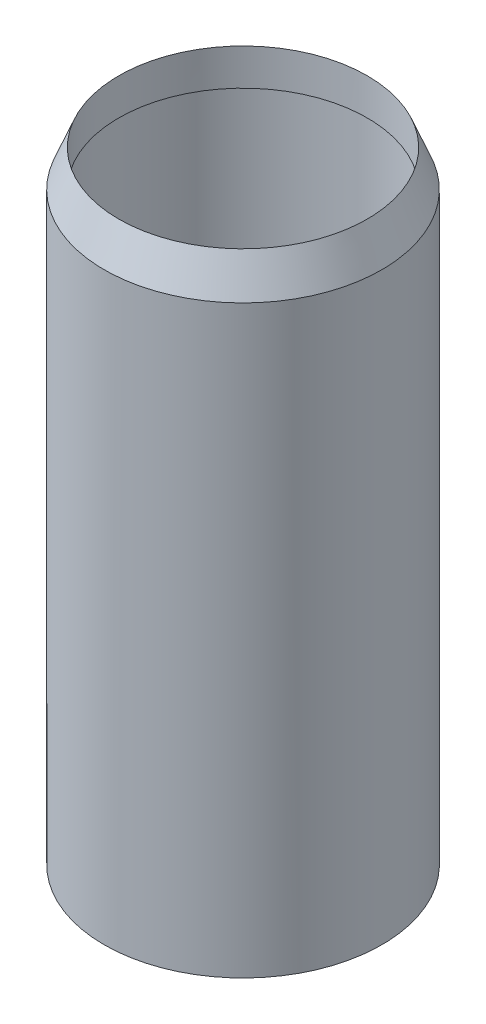
ISO-10303-21;
HEADER;
FILE_DESCRIPTION(('STEP AP214'),'2;1');
FILE_NAME('part.step','',(''),(''),'','','');
FILE_SCHEMA(('AUTOMOTIVE_DESIGN { 1 0 10303 214 1 1 1 1 }'));
ENDSEC;
DATA;
#1=APPLICATION_CONTEXT('core data for automotive mechanical design processes');
#2=APPLICATION_PROTOCOL_DEFINITION('international standard','automotive_design',2000,#1);
#3=PRODUCT_CONTEXT('',#1,'mechanical');
#4=PRODUCT('Part','Part','',(#3));
#5=PRODUCT_RELATED_PRODUCT_CATEGORY('part','',(#4));
#6=PRODUCT_DEFINITION_FORMATION('','',#4);
#7=PRODUCT_DEFINITION_CONTEXT('part definition',#1,'design');
#8=PRODUCT_DEFINITION('design','',#6,#7);
#9=PRODUCT_DEFINITION_SHAPE('','',#8);
#10=(LENGTH_UNIT() NAMED_UNIT(*) SI_UNIT(.MILLI.,.METRE.));
#11=(NAMED_UNIT(*) PLANE_ANGLE_UNIT() SI_UNIT($,.RADIAN.));
#12=(NAMED_UNIT(*) SI_UNIT($,.STERADIAN.) SOLID_ANGLE_UNIT());
#13=UNCERTAINTY_MEASURE_WITH_UNIT(LENGTH_MEASURE(1.E-05),#10,'distance_accuracy_value','');
#14=(GEOMETRIC_REPRESENTATION_CONTEXT(3) GLOBAL_UNCERTAINTY_ASSIGNED_CONTEXT((#13)) GLOBAL_UNIT_ASSIGNED_CONTEXT((#10,
#11,#12)) REPRESENTATION_CONTEXT('',''));
#15=CARTESIAN_POINT('',(0.,0.,0.));
#16=DIRECTION('',(0.,0.,1.));
#17=DIRECTION('',(1.,0.,0.));
#18=AXIS2_PLACEMENT_3D('',#15,#16,#17);
#19=CARTESIAN_POINT('',(0.,0.,0.));
#20=DIRECTION('',(0.,1.,0.));
#21=DIRECTION('',(0.,0.,1.));
#22=AXIS2_PLACEMENT_3D('',#19,#20,#21);
#23=PLANE('',#22);
#24=CARTESIAN_POINT('',(0.,0.,0.));
#25=DIRECTION('',(0.,1.,0.));
#26=DIRECTION('',(0.,0.,1.));
#27=AXIS2_PLACEMENT_3D('',#24,#25,#26);
#28=CIRCLE('',#27,19.);
#29=CARTESIAN_POINT('',(0.,0.,19.));
#30=VERTEX_POINT('',#29);
#31=EDGE_CURVE('E47',#30,#30,#28,.T.);
#32=ORIENTED_EDGE('',*,*,#31,.F.);
#33=EDGE_LOOP('',(#32));
#34=FACE_BOUND('',#33,.T.);
#35=CARTESIAN_POINT('',(0.,0.,0.));
#36=DIRECTION('',(0.,1.,0.));
#37=DIRECTION('',(0.,0.,1.));
#38=AXIS2_PLACEMENT_3D('',#35,#36,#37);
#39=CIRCLE('',#38,17.5);
#40=CARTESIAN_POINT('',(0.,0.,17.5));
#41=VERTEX_POINT('',#40);
#42=EDGE_CURVE('E52',#41,#41,#39,.T.);
#43=ORIENTED_EDGE('',*,*,#42,.T.);
#44=EDGE_LOOP('',(#43));
#45=FACE_BOUND('',#44,.T.);
#46=ADVANCED_FACE('F37',(#34,#45),#23,.F.);
#47=CARTESIAN_POINT('',(0.,80.,0.));
#48=DIRECTION('',(0.,-1.,0.));
#49=DIRECTION('',(0.,0.,-1.));
#50=AXIS2_PLACEMENT_3D('',#47,#48,#49);
#51=CYLINDRICAL_SURFACE('',#50,19.);
#52=CARTESIAN_POINT('',(0.,80.,0.));
#53=DIRECTION('',(0.,-1.,0.));
#54=DIRECTION('',(0.,0.,-1.));
#55=AXIS2_PLACEMENT_3D('',#52,#53,#54);
#56=CIRCLE('',#55,19.);
#57=CARTESIAN_POINT('',(0.,80.,-19.));
#58=VERTEX_POINT('',#57);
#59=EDGE_CURVE('E11',#58,#58,#56,.F.);
#60=ORIENTED_EDGE('',*,*,#59,.F.);
#61=EDGE_LOOP('',(#60));
#62=FACE_BOUND('',#61,.T.);
#63=ORIENTED_EDGE('',*,*,#31,.T.);
#64=EDGE_LOOP('',(#63));
#65=FACE_BOUND('',#64,.T.);
#66=ADVANCED_FACE('F39',(#62,#65),#51,.T.);
#67=CARTESIAN_POINT('',(0.,80.,0.));
#68=DIRECTION('',(0.,-1.,0.));
#69=DIRECTION('',(0.,0.,-1.));
#70=AXIS2_PLACEMENT_3D('',#67,#68,#69);
#71=CYLINDRICAL_SURFACE('',#70,17.5);
#72=CARTESIAN_POINT('',(0.,80.,0.));
#73=DIRECTION('',(0.,1.,0.));
#74=DIRECTION('',(0.,0.,1.));
#75=AXIS2_PLACEMENT_3D('',#72,#73,#74);
#76=CIRCLE('',#75,17.5);
#77=CARTESIAN_POINT('',(0.,80.,17.5));
#78=VERTEX_POINT('',#77);
#79=EDGE_CURVE('E66',#78,#78,#76,.T.);
#80=ORIENTED_EDGE('',*,*,#79,.T.);
#81=EDGE_LOOP('',(#80));
#82=FACE_BOUND('',#81,.T.);
#83=ORIENTED_EDGE('',*,*,#42,.F.);
#84=EDGE_LOOP('',(#83));
#85=FACE_BOUND('',#84,.T.);
#86=ADVANCED_FACE('F87',(#82,#85),#71,.F.);
#87=CARTESIAN_POINT('',(0.,80.,0.));
#88=DIRECTION('',(0.,1.,0.));
#89=DIRECTION('',(0.,0.,1.));
#90=AXIS2_PLACEMENT_3D('',#87,#88,#89);
#91=PLANE('',#90);
#92=CARTESIAN_POINT('',(0.,80.,0.));
#93=DIRECTION('',(0.,1.,0.));
#94=DIRECTION('',(0.,0.,1.));
#95=AXIS2_PLACEMENT_3D('',#92,#93,#94);
#96=CIRCLE('',#95,17.);
#97=CARTESIAN_POINT('',(0.,80.,17.));
#98=VERTEX_POINT('',#97);
#99=EDGE_CURVE('E64',#98,#98,#96,.T.);
#100=ORIENTED_EDGE('',*,*,#99,.T.);
#101=EDGE_LOOP('',(#100));
#102=FACE_BOUND('',#101,.T.);
#103=ORIENTED_EDGE('',*,*,#79,.F.);
#104=EDGE_LOOP('',(#103));
#105=FACE_BOUND('',#104,.T.);
#106=ADVANCED_FACE('F86',(#102,#105),#91,.F.);
#107=CARTESIAN_POINT('',(0.,85.,0.));
#108=DIRECTION('',(0.,-1.,0.));
#109=DIRECTION('',(0.,0.,-1.));
#110=AXIS2_PLACEMENT_3D('',#107,#108,#109);
#111=CONICAL_SURFACE('',#110,17.,0.380506377112364);
#112=ORIENTED_EDGE('',*,*,#59,.T.);
#113=EDGE_LOOP('',(#112));
#114=FACE_BOUND('',#113,.T.);
#115=CARTESIAN_POINT('',(0.,85.,0.));
#116=DIRECTION('',(0.,1.,0.));
#117=DIRECTION('',(0.,0.,1.));
#118=AXIS2_PLACEMENT_3D('',#115,#116,#117);
#119=CIRCLE('',#118,17.);
#120=CARTESIAN_POINT('',(0.,85.,17.));
#121=VERTEX_POINT('',#120);
#122=EDGE_CURVE('E60',#121,#121,#119,.T.);
#123=ORIENTED_EDGE('',*,*,#122,.F.);
#124=EDGE_LOOP('',(#123));
#125=FACE_BOUND('',#124,.T.);
#126=ADVANCED_FACE('F76',(#114,#125),#111,.T.);
#127=CARTESIAN_POINT('',(0.,80.,0.));
#128=DIRECTION('',(0.,1.,0.));
#129=DIRECTION('',(0.,0.,1.));
#130=AXIS2_PLACEMENT_3D('',#127,#128,#129);
#131=CYLINDRICAL_SURFACE('',#130,17.);
#132=ORIENTED_EDGE('',*,*,#99,.F.);
#133=EDGE_LOOP('',(#132));
#134=FACE_BOUND('',#133,.T.);
#135=ORIENTED_EDGE('',*,*,#122,.T.);
#136=EDGE_LOOP('',(#135));
#137=FACE_BOUND('',#136,.T.);
#138=ADVANCED_FACE('F61',(#134,#137),#131,.F.);
#139=CLOSED_SHELL('',(#46,#66,#86,#106,#126,#138));
#140=MANIFOLD_SOLID_BREP('B2',#139);
#141=ADVANCED_BREP_SHAPE_REPRESENTATION('',(#18,#140),#14);
#142=SHAPE_DEFINITION_REPRESENTATION(#9,#141);
ENDSEC;
END-ISO-10303-21;
